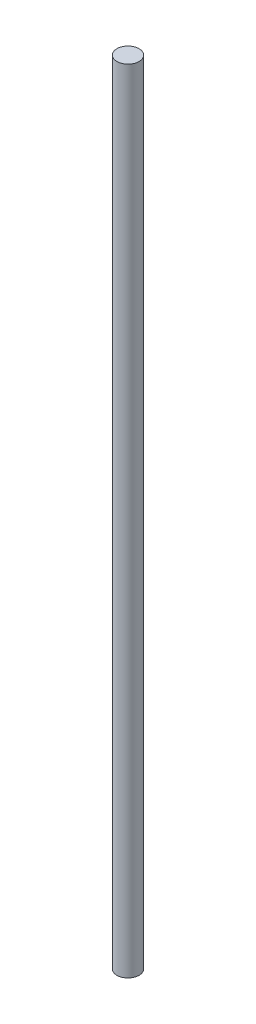
ISO-10303-21;
HEADER;
FILE_DESCRIPTION(('STEP AP214'),'2;1');
FILE_NAME('part.step','',(''),(''),'','','');
FILE_SCHEMA(('AUTOMOTIVE_DESIGN { 1 0 10303 214 1 1 1 1 }'));
ENDSEC;
DATA;
#1=APPLICATION_CONTEXT('core data for automotive mechanical design processes');
#2=APPLICATION_PROTOCOL_DEFINITION('international standard','automotive_design',2000,#1);
#3=PRODUCT_CONTEXT('',#1,'mechanical');
#4=PRODUCT('Part','Part','',(#3));
#5=PRODUCT_RELATED_PRODUCT_CATEGORY('part','',(#4));
#6=PRODUCT_DEFINITION_FORMATION('','',#4);
#7=PRODUCT_DEFINITION_CONTEXT('part definition',#1,'design');
#8=PRODUCT_DEFINITION('design','',#6,#7);
#9=PRODUCT_DEFINITION_SHAPE('','',#8);
#10=(LENGTH_UNIT() NAMED_UNIT(*) SI_UNIT(.MILLI.,.METRE.));
#11=(NAMED_UNIT(*) PLANE_ANGLE_UNIT() SI_UNIT($,.RADIAN.));
#12=(NAMED_UNIT(*) SI_UNIT($,.STERADIAN.) SOLID_ANGLE_UNIT());
#13=UNCERTAINTY_MEASURE_WITH_UNIT(LENGTH_MEASURE(1.E-05),#10,'distance_accuracy_value','');
#14=(GEOMETRIC_REPRESENTATION_CONTEXT(3) GLOBAL_UNCERTAINTY_ASSIGNED_CONTEXT((#13)) GLOBAL_UNIT_ASSIGNED_CONTEXT((#10,
#11,#12)) REPRESENTATION_CONTEXT('',''));
#15=CARTESIAN_POINT('',(0.,0.,0.));
#16=DIRECTION('',(0.,0.,1.));
#17=DIRECTION('',(1.,0.,0.));
#18=AXIS2_PLACEMENT_3D('',#15,#16,#17);
#19=CARTESIAN_POINT('',(-22.,-285.,35.0000000000001));
#20=DIRECTION('',(0.,1.,0.));
#21=DIRECTION('',(0.,0.,1.));
#22=AXIS2_PLACEMENT_3D('',#19,#20,#21);
#23=CYLINDRICAL_SURFACE('',#22,4.);
#24=CARTESIAN_POINT('',(-22.,-285.,35.0000000000001));
#25=DIRECTION('',(0.,1.,0.));
#26=DIRECTION('',(0.,0.,1.));
#27=AXIS2_PLACEMENT_3D('',#24,#25,#26);
#28=CIRCLE('',#27,4.);
#29=CARTESIAN_POINT('',(-22.,-285.,39.0000000000001));
#30=VERTEX_POINT('',#29);
#31=EDGE_CURVE('E10',#30,#30,#28,.T.);
#32=ORIENTED_EDGE('',*,*,#31,.T.);
#33=EDGE_LOOP('',(#32));
#34=FACE_BOUND('',#33,.T.);
#35=CARTESIAN_POINT('',(-22.,0.,35.0000000000001));
#36=DIRECTION('',(0.,1.,0.));
#37=DIRECTION('',(0.,0.,1.));
#38=AXIS2_PLACEMENT_3D('',#35,#36,#37);
#39=CIRCLE('',#38,4.);
#40=CARTESIAN_POINT('',(-22.,0.,39.0000000000001));
#41=VERTEX_POINT('',#40);
#42=EDGE_CURVE('E33',#41,#41,#39,.T.);
#43=ORIENTED_EDGE('',*,*,#42,.F.);
#44=EDGE_LOOP('',(#43));
#45=FACE_BOUND('',#44,.T.);
#46=ADVANCED_FACE('F30',(#34,#45),#23,.T.);
#47=CARTESIAN_POINT('',(-22.,-285.,35.0000000000001));
#48=DIRECTION('',(0.,1.,0.));
#49=DIRECTION('',(0.,0.,1.));
#50=AXIS2_PLACEMENT_3D('',#47,#48,#49);
#51=PLANE('',#50);
#52=ORIENTED_EDGE('',*,*,#31,.F.);
#53=EDGE_LOOP('',(#52));
#54=FACE_BOUND('',#53,.T.);
#55=ADVANCED_FACE('F45',(#54),#51,.F.);
#56=CARTESIAN_POINT('',(-22.,0.,35.0000000000001));
#57=DIRECTION('',(0.,1.,0.));
#58=DIRECTION('',(0.,0.,1.));
#59=AXIS2_PLACEMENT_3D('',#56,#57,#58);
#60=PLANE('',#59);
#61=ORIENTED_EDGE('',*,*,#42,.T.);
#62=EDGE_LOOP('',(#61));
#63=FACE_BOUND('',#62,.T.);
#64=ADVANCED_FACE('F42',(#63),#60,.T.);
#65=CLOSED_SHELL('',(#46,#55,#64));
#66=MANIFOLD_SOLID_BREP('B2',#65);
#67=ADVANCED_BREP_SHAPE_REPRESENTATION('',(#18,#66),#14);
#68=SHAPE_DEFINITION_REPRESENTATION(#9,#67);
ENDSEC;
END-ISO-10303-21;
